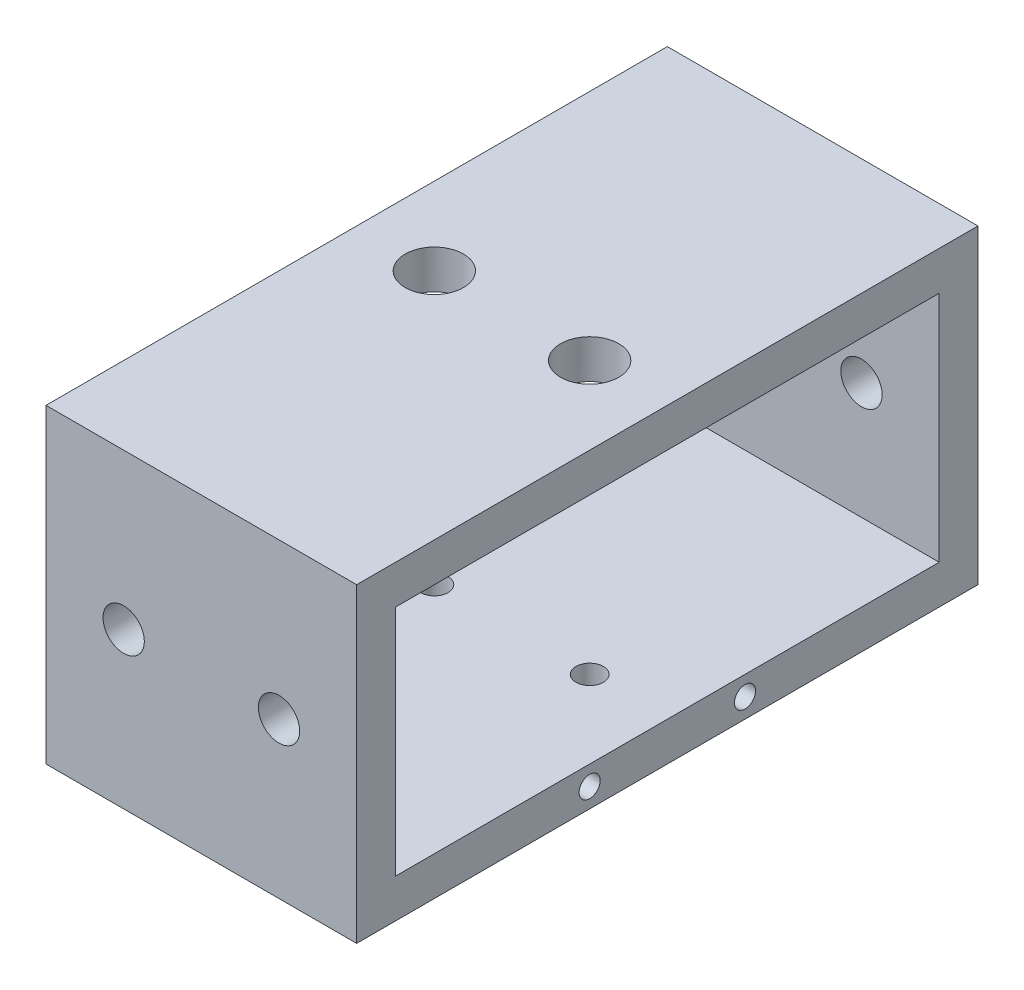
ISO-10303-21;
HEADER;
FILE_DESCRIPTION(('STEP AP214'),'2;1');
FILE_NAME('part.step','',(''),(''),'','','');
FILE_SCHEMA(('AUTOMOTIVE_DESIGN { 1 0 10303 214 1 1 1 1 }'));
ENDSEC;
DATA;
#1=APPLICATION_CONTEXT('core data for automotive mechanical design processes');
#2=APPLICATION_PROTOCOL_DEFINITION('international standard','automotive_design',2000,#1);
#3=PRODUCT_CONTEXT('',#1,'mechanical');
#4=PRODUCT('Part','Part','',(#3));
#5=PRODUCT_RELATED_PRODUCT_CATEGORY('part','',(#4));
#6=PRODUCT_DEFINITION_FORMATION('','',#4);
#7=PRODUCT_DEFINITION_CONTEXT('part definition',#1,'design');
#8=PRODUCT_DEFINITION('design','',#6,#7);
#9=PRODUCT_DEFINITION_SHAPE('','',#8);
#10=(LENGTH_UNIT() NAMED_UNIT(*) SI_UNIT(.MILLI.,.METRE.));
#11=(NAMED_UNIT(*) PLANE_ANGLE_UNIT() SI_UNIT($,.RADIAN.));
#12=(NAMED_UNIT(*) SI_UNIT($,.STERADIAN.) SOLID_ANGLE_UNIT());
#13=UNCERTAINTY_MEASURE_WITH_UNIT(LENGTH_MEASURE(1.E-05),#10,'distance_accuracy_value','');
#14=(GEOMETRIC_REPRESENTATION_CONTEXT(3) GLOBAL_UNCERTAINTY_ASSIGNED_CONTEXT((#13)) GLOBAL_UNIT_ASSIGNED_CONTEXT((#10,
#11,#12)) REPRESENTATION_CONTEXT('',''));
#15=CARTESIAN_POINT('',(0.,0.,0.));
#16=DIRECTION('',(0.,0.,1.));
#17=DIRECTION('',(1.,0.,0.));
#18=AXIS2_PLACEMENT_3D('',#15,#16,#17);
#19=CARTESIAN_POINT('',(25.4,25.4,50.8));
#20=DIRECTION('',(0.,-1.,0.));
#21=DIRECTION('',(0.,0.,-1.));
#22=AXIS2_PLACEMENT_3D('',#19,#20,#21);
#23=PLANE('',#22);
#24=CARTESIAN_POINT('',(12.7,25.4,0.));
#25=DIRECTION('',(0.,1.,0.));
#26=DIRECTION('',(0.,0.,1.));
#27=AXIS2_PLACEMENT_3D('',#24,#25,#26);
#28=CIRCLE('',#27,4.7625);
#29=CARTESIAN_POINT('',(12.7,25.4,4.7625));
#30=VERTEX_POINT('',#29);
#31=EDGE_CURVE('E139',#30,#30,#28,.T.);
#32=ORIENTED_EDGE('',*,*,#31,.F.);
#33=EDGE_LOOP('',(#32));
#34=FACE_BOUND('',#33,.T.);
#35=DIRECTION('',(0.,0.,1.));
#36=VECTOR('',#35,1.);
#37=CARTESIAN_POINT('',(-25.4,25.4,50.8));
#38=LINE('',#37,#36);
#39=CARTESIAN_POINT('',(-25.4,25.4,-50.8));
#40=VERTEX_POINT('',#39);
#41=CARTESIAN_POINT('',(-25.4,25.4,50.8));
#42=VERTEX_POINT('',#41);
#43=EDGE_CURVE('E215',#40,#42,#38,.T.);
#44=ORIENTED_EDGE('',*,*,#43,.T.);
#45=DIRECTION('',(-1.,0.,0.));
#46=VECTOR('',#45,1.);
#47=CARTESIAN_POINT('',(25.4,25.4,50.8));
#48=LINE('',#47,#46);
#49=CARTESIAN_POINT('',(25.4,25.4,50.8));
#50=VERTEX_POINT('',#49);
#51=EDGE_CURVE('E48',#50,#42,#48,.T.);
#52=ORIENTED_EDGE('',*,*,#51,.F.);
#53=DIRECTION('',(0.,0.,1.));
#54=VECTOR('',#53,1.);
#55=CARTESIAN_POINT('',(25.4,25.4,50.8));
#56=LINE('',#55,#54);
#57=CARTESIAN_POINT('',(25.4,25.4,-50.8));
#58=VERTEX_POINT('',#57);
#59=EDGE_CURVE('E205',#58,#50,#56,.T.);
#60=ORIENTED_EDGE('',*,*,#59,.F.);
#61=DIRECTION('',(-1.,0.,0.));
#62=VECTOR('',#61,1.);
#63=CARTESIAN_POINT('',(25.4,25.4,-50.8));
#64=LINE('',#63,#62);
#65=EDGE_CURVE('E11',#58,#40,#64,.T.);
#66=ORIENTED_EDGE('',*,*,#65,.T.);
#67=EDGE_LOOP('',(#44,#52,#60,#66));
#68=FACE_BOUND('',#67,.T.);
#69=CARTESIAN_POINT('',(-12.7,25.4,0.));
#70=DIRECTION('',(0.,1.,0.));
#71=DIRECTION('',(0.,0.,1.));
#72=AXIS2_PLACEMENT_3D('',#69,#70,#71);
#73=CIRCLE('',#72,4.7625);
#74=CARTESIAN_POINT('',(-12.7,25.4,4.7625));
#75=VERTEX_POINT('',#74);
#76=EDGE_CURVE('E133',#75,#75,#73,.T.);
#77=ORIENTED_EDGE('',*,*,#76,.F.);
#78=EDGE_LOOP('',(#77));
#79=FACE_BOUND('',#78,.T.);
#80=ADVANCED_FACE('F39',(#34,#68,#79),#23,.F.);
#81=CARTESIAN_POINT('',(25.4,-25.4,50.8));
#82=DIRECTION('',(0.,0.,-1.));
#83=DIRECTION('',(-1.,0.,0.));
#84=AXIS2_PLACEMENT_3D('',#81,#82,#83);
#85=PLANE('',#84);
#86=CARTESIAN_POINT('',(-12.7,0.,50.8));
#87=DIRECTION('',(0.,0.,1.));
#88=DIRECTION('',(1.,0.,0.));
#89=AXIS2_PLACEMENT_3D('',#86,#87,#88);
#90=CIRCLE('',#89,3.37819999999999);
#91=CARTESIAN_POINT('',(-9.3218,0.,50.8));
#92=VERTEX_POINT('',#91);
#93=EDGE_CURVE('E157',#92,#92,#90,.T.);
#94=ORIENTED_EDGE('',*,*,#93,.F.);
#95=EDGE_LOOP('',(#94));
#96=FACE_BOUND('',#95,.T.);
#97=DIRECTION('',(0.,-1.,0.));
#98=VECTOR('',#97,1.);
#99=CARTESIAN_POINT('',(-25.4,-25.4,50.8));
#100=LINE('',#99,#98);
#101=CARTESIAN_POINT('',(-25.4,-25.4,50.8));
#102=VERTEX_POINT('',#101);
#103=EDGE_CURVE('E217',#42,#102,#100,.T.);
#104=ORIENTED_EDGE('',*,*,#103,.T.);
#105=DIRECTION('',(-1.,0.,0.));
#106=VECTOR('',#105,1.);
#107=CARTESIAN_POINT('',(25.4,-25.4,50.8));
#108=LINE('',#107,#106);
#109=CARTESIAN_POINT('',(25.4,-25.4,50.8));
#110=VERTEX_POINT('',#109);
#111=EDGE_CURVE('E222',#110,#102,#108,.T.);
#112=ORIENTED_EDGE('',*,*,#111,.F.);
#113=DIRECTION('',(0.,-1.,0.));
#114=VECTOR('',#113,1.);
#115=CARTESIAN_POINT('',(25.4,-25.4,50.8));
#116=LINE('',#115,#114);
#117=EDGE_CURVE('E208',#50,#110,#116,.T.);
#118=ORIENTED_EDGE('',*,*,#117,.F.);
#119=ORIENTED_EDGE('',*,*,#51,.T.);
#120=EDGE_LOOP('',(#104,#112,#118,#119));
#121=FACE_BOUND('',#120,.T.);
#122=CARTESIAN_POINT('',(12.7,0.,50.8));
#123=DIRECTION('',(0.,0.,1.));
#124=DIRECTION('',(1.,0.,0.));
#125=AXIS2_PLACEMENT_3D('',#122,#123,#124);
#126=CIRCLE('',#125,3.37819999999999);
#127=CARTESIAN_POINT('',(16.0782,0.,50.8));
#128=VERTEX_POINT('',#127);
#129=EDGE_CURVE('E166',#128,#128,#126,.T.);
#130=ORIENTED_EDGE('',*,*,#129,.F.);
#131=EDGE_LOOP('',(#130));
#132=FACE_BOUND('',#131,.T.);
#133=ADVANCED_FACE('F250',(#96,#121,#132),#85,.F.);
#134=CARTESIAN_POINT('',(25.4,0.,0.));
#135=DIRECTION('',(-1.,0.,0.));
#136=DIRECTION('',(0.,0.,1.));
#137=AXIS2_PLACEMENT_3D('',#134,#135,#136);
#138=PLANE('',#137);
#139=CARTESIAN_POINT('',(25.4,-22.225,-12.7));
#140=DIRECTION('',(1.,0.,0.));
#141=DIRECTION('',(0.,0.,-1.));
#142=AXIS2_PLACEMENT_3D('',#139,#140,#141);
#143=CIRCLE('',#142,1.72719999999999);
#144=CARTESIAN_POINT('',(25.4,-22.225,-14.4272));
#145=VERTEX_POINT('',#144);
#146=EDGE_CURVE('E123',#145,#145,#143,.T.);
#147=ORIENTED_EDGE('',*,*,#146,.F.);
#148=EDGE_LOOP('',(#147));
#149=FACE_BOUND('',#148,.T.);
#150=CARTESIAN_POINT('',(25.4,-22.225,12.7));
#151=DIRECTION('',(1.,0.,0.));
#152=DIRECTION('',(0.,0.,-1.));
#153=AXIS2_PLACEMENT_3D('',#150,#151,#152);
#154=CIRCLE('',#153,1.72719999999999);
#155=CARTESIAN_POINT('',(25.4,-22.225,10.9728));
#156=VERTEX_POINT('',#155);
#157=EDGE_CURVE('E122',#156,#156,#154,.T.);
#158=ORIENTED_EDGE('',*,*,#157,.F.);
#159=EDGE_LOOP('',(#158));
#160=FACE_BOUND('',#159,.T.);
#161=DIRECTION('',(0.,1.,0.));
#162=VECTOR('',#161,1.);
#163=CARTESIAN_POINT('',(25.4,-25.4,-50.8));
#164=LINE('',#163,#162);
#165=CARTESIAN_POINT('',(25.4,-25.4,-50.8));
#166=VERTEX_POINT('',#165);
#167=EDGE_CURVE('E202',#166,#58,#164,.T.);
#168=ORIENTED_EDGE('',*,*,#167,.T.);
#169=ORIENTED_EDGE('',*,*,#59,.T.);
#170=ORIENTED_EDGE('',*,*,#117,.T.);
#171=DIRECTION('',(0.,0.,-1.));
#172=VECTOR('',#171,1.);
#173=CARTESIAN_POINT('',(25.4,-25.4,50.8));
#174=LINE('',#173,#172);
#175=EDGE_CURVE('E210',#110,#166,#174,.T.);
#176=ORIENTED_EDGE('',*,*,#175,.T.);
#177=EDGE_LOOP('',(#168,#169,#170,#176));
#178=FACE_BOUND('',#177,.T.);
#179=DIRECTION('',(0.,1.,0.));
#180=VECTOR('',#179,1.);
#181=CARTESIAN_POINT('',(25.4,-19.05,-44.45));
#182=LINE('',#181,#180);
#183=CARTESIAN_POINT('',(25.4,-19.05,-44.45));
#184=VERTEX_POINT('',#183);
#185=CARTESIAN_POINT('',(25.4,19.05,-44.45));
#186=VERTEX_POINT('',#185);
#187=EDGE_CURVE('E176',#184,#186,#182,.T.);
#188=ORIENTED_EDGE('',*,*,#187,.F.);
#189=DIRECTION('',(0.,0.,-1.));
#190=VECTOR('',#189,1.);
#191=CARTESIAN_POINT('',(25.4,-19.05,44.45));
#192=LINE('',#191,#190);
#193=CARTESIAN_POINT('',(25.4,-19.05,44.45));
#194=VERTEX_POINT('',#193);
#195=EDGE_CURVE('E183',#194,#184,#192,.T.);
#196=ORIENTED_EDGE('',*,*,#195,.F.);
#197=DIRECTION('',(0.,-1.,0.));
#198=VECTOR('',#197,1.);
#199=CARTESIAN_POINT('',(25.4,-19.05,44.45));
#200=LINE('',#199,#198);
#201=CARTESIAN_POINT('',(25.4,19.05,44.45));
#202=VERTEX_POINT('',#201);
#203=EDGE_CURVE('E181',#202,#194,#200,.T.);
#204=ORIENTED_EDGE('',*,*,#203,.F.);
#205=DIRECTION('',(0.,0.,1.));
#206=VECTOR('',#205,1.);
#207=CARTESIAN_POINT('',(25.4,19.05,44.45));
#208=LINE('',#207,#206);
#209=EDGE_CURVE('E178',#186,#202,#208,.T.);
#210=ORIENTED_EDGE('',*,*,#209,.F.);
#211=EDGE_LOOP('',(#188,#196,#204,#210));
#212=FACE_BOUND('',#211,.T.);
#213=ADVANCED_FACE('F255',(#149,#160,#178,#212),#138,.F.);
#214=CARTESIAN_POINT('',(-25.4,0.,0.));
#215=DIRECTION('',(-1.,0.,0.));
#216=DIRECTION('',(0.,0.,1.));
#217=AXIS2_PLACEMENT_3D('',#214,#215,#216);
#218=PLANE('',#217);
#219=DIRECTION('',(0.,1.,0.));
#220=VECTOR('',#219,1.);
#221=CARTESIAN_POINT('',(-25.4,-25.4,-50.8));
#222=LINE('',#221,#220);
#223=CARTESIAN_POINT('',(-25.4,-25.4,-50.8));
#224=VERTEX_POINT('',#223);
#225=EDGE_CURVE('E201',#224,#40,#222,.T.);
#226=ORIENTED_EDGE('',*,*,#225,.F.);
#227=DIRECTION('',(0.,0.,-1.));
#228=VECTOR('',#227,1.);
#229=CARTESIAN_POINT('',(-25.4,-25.4,50.8));
#230=LINE('',#229,#228);
#231=EDGE_CURVE('E206',#102,#224,#230,.T.);
#232=ORIENTED_EDGE('',*,*,#231,.F.);
#233=ORIENTED_EDGE('',*,*,#103,.F.);
#234=ORIENTED_EDGE('',*,*,#43,.F.);
#235=EDGE_LOOP('',(#226,#232,#233,#234));
#236=FACE_BOUND('',#235,.T.);
#237=DIRECTION('',(0.,0.,-1.));
#238=VECTOR('',#237,1.);
#239=CARTESIAN_POINT('',(-25.4,-19.05,44.45));
#240=LINE('',#239,#238);
#241=CARTESIAN_POINT('',(-25.4,-19.05,44.45));
#242=VERTEX_POINT('',#241);
#243=CARTESIAN_POINT('',(-25.4,-19.05,-44.45));
#244=VERTEX_POINT('',#243);
#245=EDGE_CURVE('E179',#242,#244,#240,.T.);
#246=ORIENTED_EDGE('',*,*,#245,.T.);
#247=DIRECTION('',(0.,1.,0.));
#248=VECTOR('',#247,1.);
#249=CARTESIAN_POINT('',(-25.4,-19.05,-44.45));
#250=LINE('',#249,#248);
#251=CARTESIAN_POINT('',(-25.4,19.05,-44.45));
#252=VERTEX_POINT('',#251);
#253=EDGE_CURVE('E64',#244,#252,#250,.T.);
#254=ORIENTED_EDGE('',*,*,#253,.T.);
#255=DIRECTION('',(0.,0.,1.));
#256=VECTOR('',#255,1.);
#257=CARTESIAN_POINT('',(-25.4,19.05,44.45));
#258=LINE('',#257,#256);
#259=CARTESIAN_POINT('',(-25.4,19.05,44.45));
#260=VERTEX_POINT('',#259);
#261=EDGE_CURVE('E187',#252,#260,#258,.T.);
#262=ORIENTED_EDGE('',*,*,#261,.T.);
#263=DIRECTION('',(0.,-1.,0.));
#264=VECTOR('',#263,1.);
#265=CARTESIAN_POINT('',(-25.4,-19.05,44.45));
#266=LINE('',#265,#264);
#267=EDGE_CURVE('E190',#260,#242,#266,.T.);
#268=ORIENTED_EDGE('',*,*,#267,.T.);
#269=EDGE_LOOP('',(#246,#254,#262,#268));
#270=FACE_BOUND('',#269,.T.);
#271=ADVANCED_FACE('F261',(#236,#270),#218,.T.);
#272=CARTESIAN_POINT('',(25.4,-25.4,-50.8));
#273=DIRECTION('',(0.,0.,1.));
#274=DIRECTION('',(1.,0.,0.));
#275=AXIS2_PLACEMENT_3D('',#272,#273,#274);
#276=PLANE('',#275);
#277=CARTESIAN_POINT('',(-12.7,0.,-50.8));
#278=DIRECTION('',(0.,0.,1.));
#279=DIRECTION('',(1.,0.,0.));
#280=AXIS2_PLACEMENT_3D('',#277,#278,#279);
#281=CIRCLE('',#280,3.37819999999998);
#282=CARTESIAN_POINT('',(-9.32180000000002,0.,-50.8));
#283=VERTEX_POINT('',#282);
#284=EDGE_CURVE('E160',#283,#283,#281,.T.);
#285=ORIENTED_EDGE('',*,*,#284,.T.);
#286=EDGE_LOOP('',(#285));
#287=FACE_BOUND('',#286,.T.);
#288=CARTESIAN_POINT('',(12.7,0.,-50.8));
#289=DIRECTION('',(0.,0.,1.));
#290=DIRECTION('',(1.,0.,0.));
#291=AXIS2_PLACEMENT_3D('',#288,#289,#290);
#292=CIRCLE('',#291,3.37819999999998);
#293=CARTESIAN_POINT('',(16.0782,0.,-50.8));
#294=VERTEX_POINT('',#293);
#295=EDGE_CURVE('E169',#294,#294,#292,.T.);
#296=ORIENTED_EDGE('',*,*,#295,.T.);
#297=EDGE_LOOP('',(#296));
#298=FACE_BOUND('',#297,.T.);
#299=ORIENTED_EDGE('',*,*,#225,.T.);
#300=ORIENTED_EDGE('',*,*,#65,.F.);
#301=ORIENTED_EDGE('',*,*,#167,.F.);
#302=DIRECTION('',(-1.,0.,0.));
#303=VECTOR('',#302,1.);
#304=CARTESIAN_POINT('',(25.4,-25.4,-50.8));
#305=LINE('',#304,#303);
#306=EDGE_CURVE('E212',#166,#224,#305,.T.);
#307=ORIENTED_EDGE('',*,*,#306,.T.);
#308=EDGE_LOOP('',(#299,#300,#301,#307));
#309=FACE_BOUND('',#308,.T.);
#310=ADVANCED_FACE('F41',(#287,#298,#309),#276,.F.);
#311=CARTESIAN_POINT('',(25.4,-25.4,50.8));
#312=DIRECTION('',(0.,1.,0.));
#313=DIRECTION('',(0.,0.,1.));
#314=AXIS2_PLACEMENT_3D('',#311,#312,#313);
#315=PLANE('',#314);
#316=CARTESIAN_POINT('',(-12.7,-25.4,0.));
#317=DIRECTION('',(0.,1.,0.));
#318=DIRECTION('',(0.,0.,1.));
#319=AXIS2_PLACEMENT_3D('',#316,#317,#318);
#320=CIRCLE('',#319,2.2479);
#321=CARTESIAN_POINT('',(-12.7,-25.4,2.2479));
#322=VERTEX_POINT('',#321);
#323=EDGE_CURVE('E148',#322,#322,#320,.T.);
#324=ORIENTED_EDGE('',*,*,#323,.T.);
#325=EDGE_LOOP('',(#324));
#326=FACE_BOUND('',#325,.T.);
#327=CARTESIAN_POINT('',(12.7,-25.4,0.));
#328=DIRECTION('',(0.,1.,0.));
#329=DIRECTION('',(0.,0.,1.));
#330=AXIS2_PLACEMENT_3D('',#327,#328,#329);
#331=CIRCLE('',#330,2.2479);
#332=CARTESIAN_POINT('',(12.7,-25.4,2.2479));
#333=VERTEX_POINT('',#332);
#334=EDGE_CURVE('E154',#333,#333,#331,.T.);
#335=ORIENTED_EDGE('',*,*,#334,.T.);
#336=EDGE_LOOP('',(#335));
#337=FACE_BOUND('',#336,.T.);
#338=ORIENTED_EDGE('',*,*,#231,.T.);
#339=ORIENTED_EDGE('',*,*,#306,.F.);
#340=ORIENTED_EDGE('',*,*,#175,.F.);
#341=ORIENTED_EDGE('',*,*,#111,.T.);
#342=EDGE_LOOP('',(#338,#339,#340,#341));
#343=FACE_BOUND('',#342,.T.);
#344=ADVANCED_FACE('F235',(#326,#337,#343),#315,.F.);
#345=CARTESIAN_POINT('',(25.4,-19.05,-44.45));
#346=DIRECTION('',(0.,0.,1.));
#347=DIRECTION('',(1.,0.,0.));
#348=AXIS2_PLACEMENT_3D('',#345,#346,#347);
#349=PLANE('',#348);
#350=CARTESIAN_POINT('',(-12.7,0.,-44.45));
#351=DIRECTION('',(0.,0.,1.));
#352=DIRECTION('',(1.,0.,0.));
#353=AXIS2_PLACEMENT_3D('',#350,#351,#352);
#354=CIRCLE('',#353,3.37819999999999);
#355=CARTESIAN_POINT('',(-9.32180000000001,0.,-44.45));
#356=VERTEX_POINT('',#355);
#357=EDGE_CURVE('E163',#356,#356,#354,.T.);
#358=ORIENTED_EDGE('',*,*,#357,.F.);
#359=EDGE_LOOP('',(#358));
#360=FACE_BOUND('',#359,.T.);
#361=CARTESIAN_POINT('',(12.7,0.,-44.45));
#362=DIRECTION('',(0.,0.,1.));
#363=DIRECTION('',(1.,0.,0.));
#364=AXIS2_PLACEMENT_3D('',#361,#362,#363);
#365=CIRCLE('',#364,3.37819999999999);
#366=CARTESIAN_POINT('',(16.0782,0.,-44.45));
#367=VERTEX_POINT('',#366);
#368=EDGE_CURVE('E172',#367,#367,#365,.T.);
#369=ORIENTED_EDGE('',*,*,#368,.F.);
#370=EDGE_LOOP('',(#369));
#371=FACE_BOUND('',#370,.T.);
#372=ORIENTED_EDGE('',*,*,#253,.F.);
#373=DIRECTION('',(-1.,0.,0.));
#374=VECTOR('',#373,1.);
#375=CARTESIAN_POINT('',(25.4,-19.05,-44.45));
#376=LINE('',#375,#374);
#377=EDGE_CURVE('E185',#184,#244,#376,.T.);
#378=ORIENTED_EDGE('',*,*,#377,.F.);
#379=ORIENTED_EDGE('',*,*,#187,.T.);
#380=DIRECTION('',(-1.,0.,0.));
#381=VECTOR('',#380,1.);
#382=CARTESIAN_POINT('',(25.4,19.05,-44.45));
#383=LINE('',#382,#381);
#384=EDGE_CURVE('E199',#186,#252,#383,.T.);
#385=ORIENTED_EDGE('',*,*,#384,.T.);
#386=EDGE_LOOP('',(#372,#378,#379,#385));
#387=FACE_BOUND('',#386,.T.);
#388=ADVANCED_FACE('F232',(#360,#371,#387),#349,.T.);
#389=CARTESIAN_POINT('',(25.4,19.05,44.45));
#390=DIRECTION('',(0.,-1.,0.));
#391=DIRECTION('',(0.,0.,-1.));
#392=AXIS2_PLACEMENT_3D('',#389,#390,#391);
#393=PLANE('',#392);
#394=CARTESIAN_POINT('',(-12.7,19.05,0.));
#395=DIRECTION('',(0.,-1.,0.));
#396=DIRECTION('',(0.,0.,-1.));
#397=AXIS2_PLACEMENT_3D('',#394,#395,#396);
#398=CIRCLE('',#397,4.7625);
#399=CARTESIAN_POINT('',(-12.7,19.05,-4.76249999999999));
#400=VERTEX_POINT('',#399);
#401=EDGE_CURVE('E136',#400,#400,#398,.T.);
#402=ORIENTED_EDGE('',*,*,#401,.F.);
#403=EDGE_LOOP('',(#402));
#404=FACE_BOUND('',#403,.T.);
#405=CARTESIAN_POINT('',(12.7,19.05,0.));
#406=DIRECTION('',(0.,-1.,0.));
#407=DIRECTION('',(0.,0.,-1.));
#408=AXIS2_PLACEMENT_3D('',#405,#406,#407);
#409=CIRCLE('',#408,4.7625);
#410=CARTESIAN_POINT('',(12.7,19.05,-4.7625));
#411=VERTEX_POINT('',#410);
#412=EDGE_CURVE('E142',#411,#411,#409,.T.);
#413=ORIENTED_EDGE('',*,*,#412,.F.);
#414=EDGE_LOOP('',(#413));
#415=FACE_BOUND('',#414,.T.);
#416=ORIENTED_EDGE('',*,*,#261,.F.);
#417=ORIENTED_EDGE('',*,*,#384,.F.);
#418=ORIENTED_EDGE('',*,*,#209,.T.);
#419=DIRECTION('',(-1.,0.,0.));
#420=VECTOR('',#419,1.);
#421=CARTESIAN_POINT('',(25.4,19.05,44.45));
#422=LINE('',#421,#420);
#423=EDGE_CURVE('E197',#202,#260,#422,.T.);
#424=ORIENTED_EDGE('',*,*,#423,.T.);
#425=EDGE_LOOP('',(#416,#417,#418,#424));
#426=FACE_BOUND('',#425,.T.);
#427=ADVANCED_FACE('F234',(#404,#415,#426),#393,.T.);
#428=CARTESIAN_POINT('',(25.4,-19.05,44.45));
#429=DIRECTION('',(0.,0.,-1.));
#430=DIRECTION('',(-1.,0.,0.));
#431=AXIS2_PLACEMENT_3D('',#428,#429,#430);
#432=PLANE('',#431);
#433=CARTESIAN_POINT('',(-12.7,0.,44.45));
#434=DIRECTION('',(0.,0.,-1.));
#435=DIRECTION('',(-1.,0.,0.));
#436=AXIS2_PLACEMENT_3D('',#433,#434,#435);
#437=CIRCLE('',#436,3.37819999999999);
#438=CARTESIAN_POINT('',(-16.0782,0.,44.45));
#439=VERTEX_POINT('',#438);
#440=EDGE_CURVE('E43',#439,#439,#437,.T.);
#441=ORIENTED_EDGE('',*,*,#440,.F.);
#442=EDGE_LOOP('',(#441));
#443=FACE_BOUND('',#442,.T.);
#444=CARTESIAN_POINT('',(12.7,0.,44.45));
#445=DIRECTION('',(0.,0.,-1.));
#446=DIRECTION('',(-1.,0.,0.));
#447=AXIS2_PLACEMENT_3D('',#444,#445,#446);
#448=CIRCLE('',#447,3.37819999999999);
#449=CARTESIAN_POINT('',(9.32180000000001,0.,44.45));
#450=VERTEX_POINT('',#449);
#451=EDGE_CURVE('E173',#450,#450,#448,.T.);
#452=ORIENTED_EDGE('',*,*,#451,.F.);
#453=EDGE_LOOP('',(#452));
#454=FACE_BOUND('',#453,.T.);
#455=ORIENTED_EDGE('',*,*,#267,.F.);
#456=ORIENTED_EDGE('',*,*,#423,.F.);
#457=ORIENTED_EDGE('',*,*,#203,.T.);
#458=DIRECTION('',(-1.,0.,0.));
#459=VECTOR('',#458,1.);
#460=CARTESIAN_POINT('',(25.4,-19.05,44.45));
#461=LINE('',#460,#459);
#462=EDGE_CURVE('E56',#194,#242,#461,.T.);
#463=ORIENTED_EDGE('',*,*,#462,.T.);
#464=EDGE_LOOP('',(#455,#456,#457,#463));
#465=FACE_BOUND('',#464,.T.);
#466=ADVANCED_FACE('F242',(#443,#454,#465),#432,.T.);
#467=CARTESIAN_POINT('',(25.4,-19.05,44.45));
#468=DIRECTION('',(0.,1.,0.));
#469=DIRECTION('',(0.,0.,1.));
#470=AXIS2_PLACEMENT_3D('',#467,#468,#469);
#471=PLANE('',#470);
#472=CARTESIAN_POINT('',(-12.7,-19.05,0.));
#473=DIRECTION('',(0.,1.,0.));
#474=DIRECTION('',(0.,0.,1.));
#475=AXIS2_PLACEMENT_3D('',#472,#473,#474);
#476=CIRCLE('',#475,2.2479);
#477=CARTESIAN_POINT('',(-12.7,-19.05,2.2479));
#478=VERTEX_POINT('',#477);
#479=EDGE_CURVE('E145',#478,#478,#476,.T.);
#480=ORIENTED_EDGE('',*,*,#479,.F.);
#481=EDGE_LOOP('',(#480));
#482=FACE_BOUND('',#481,.T.);
#483=CARTESIAN_POINT('',(12.7,-19.05,0.));
#484=DIRECTION('',(0.,1.,0.));
#485=DIRECTION('',(0.,0.,1.));
#486=AXIS2_PLACEMENT_3D('',#483,#484,#485);
#487=CIRCLE('',#486,2.2479);
#488=CARTESIAN_POINT('',(12.7,-19.05,2.2479));
#489=VERTEX_POINT('',#488);
#490=EDGE_CURVE('E151',#489,#489,#487,.T.);
#491=ORIENTED_EDGE('',*,*,#490,.F.);
#492=EDGE_LOOP('',(#491));
#493=FACE_BOUND('',#492,.T.);
#494=ORIENTED_EDGE('',*,*,#245,.F.);
#495=ORIENTED_EDGE('',*,*,#462,.F.);
#496=ORIENTED_EDGE('',*,*,#195,.T.);
#497=ORIENTED_EDGE('',*,*,#377,.T.);
#498=EDGE_LOOP('',(#494,#495,#496,#497));
#499=FACE_BOUND('',#498,.T.);
#500=ADVANCED_FACE('F284',(#482,#493,#499),#471,.T.);
#501=CARTESIAN_POINT('',(12.7,0.,50.8));
#502=DIRECTION('',(0.,0.,1.));
#503=DIRECTION('',(1.,0.,0.));
#504=AXIS2_PLACEMENT_3D('',#501,#502,#503);
#505=CYLINDRICAL_SURFACE('',#504,3.37819999999999);
#506=ORIENTED_EDGE('',*,*,#368,.T.);
#507=EDGE_LOOP('',(#506));
#508=FACE_BOUND('',#507,.T.);
#509=ORIENTED_EDGE('',*,*,#295,.F.);
#510=EDGE_LOOP('',(#509));
#511=FACE_BOUND('',#510,.T.);
#512=ADVANCED_FACE('F229',(#508,#511),#505,.F.);
#513=ORIENTED_EDGE('',*,*,#451,.T.);
#514=EDGE_LOOP('',(#513));
#515=FACE_BOUND('',#514,.T.);
#516=ORIENTED_EDGE('',*,*,#129,.T.);
#517=EDGE_LOOP('',(#516));
#518=FACE_BOUND('',#517,.T.);
#519=ADVANCED_FACE('F292',(#515,#518),#505,.F.);
#520=CARTESIAN_POINT('',(-12.7,0.,50.8));
#521=DIRECTION('',(0.,0.,1.));
#522=DIRECTION('',(1.,0.,0.));
#523=AXIS2_PLACEMENT_3D('',#520,#521,#522);
#524=CYLINDRICAL_SURFACE('',#523,3.37819999999999);
#525=ORIENTED_EDGE('',*,*,#440,.T.);
#526=EDGE_LOOP('',(#525));
#527=FACE_BOUND('',#526,.T.);
#528=ORIENTED_EDGE('',*,*,#93,.T.);
#529=EDGE_LOOP('',(#528));
#530=FACE_BOUND('',#529,.T.);
#531=ADVANCED_FACE('F299',(#527,#530),#524,.F.);
#532=ORIENTED_EDGE('',*,*,#357,.T.);
#533=EDGE_LOOP('',(#532));
#534=FACE_BOUND('',#533,.T.);
#535=ORIENTED_EDGE('',*,*,#284,.F.);
#536=EDGE_LOOP('',(#535));
#537=FACE_BOUND('',#536,.T.);
#538=ADVANCED_FACE('F302',(#534,#537),#524,.F.);
#539=CARTESIAN_POINT('',(12.7,-19.05,0.));
#540=DIRECTION('',(0.,1.,0.));
#541=DIRECTION('',(0.,0.,1.));
#542=AXIS2_PLACEMENT_3D('',#539,#540,#541);
#543=CYLINDRICAL_SURFACE('',#542,2.2479);
#544=ORIENTED_EDGE('',*,*,#334,.F.);
#545=EDGE_LOOP('',(#544));
#546=FACE_BOUND('',#545,.T.);
#547=ORIENTED_EDGE('',*,*,#490,.T.);
#548=EDGE_LOOP('',(#547));
#549=FACE_BOUND('',#548,.T.);
#550=ADVANCED_FACE('F304',(#546,#549),#543,.F.);
#551=CARTESIAN_POINT('',(-12.7,-19.05,0.));
#552=DIRECTION('',(0.,1.,0.));
#553=DIRECTION('',(0.,0.,1.));
#554=AXIS2_PLACEMENT_3D('',#551,#552,#553);
#555=CYLINDRICAL_SURFACE('',#554,2.2479);
#556=ORIENTED_EDGE('',*,*,#323,.F.);
#557=EDGE_LOOP('',(#556));
#558=FACE_BOUND('',#557,.T.);
#559=ORIENTED_EDGE('',*,*,#479,.T.);
#560=EDGE_LOOP('',(#559));
#561=FACE_BOUND('',#560,.T.);
#562=ADVANCED_FACE('F307',(#558,#561),#555,.F.);
#563=CARTESIAN_POINT('',(12.7,25.4,0.));
#564=DIRECTION('',(0.,1.,0.));
#565=DIRECTION('',(0.,0.,1.));
#566=AXIS2_PLACEMENT_3D('',#563,#564,#565);
#567=CYLINDRICAL_SURFACE('',#566,4.7625);
#568=ORIENTED_EDGE('',*,*,#31,.T.);
#569=EDGE_LOOP('',(#568));
#570=FACE_BOUND('',#569,.T.);
#571=ORIENTED_EDGE('',*,*,#412,.T.);
#572=EDGE_LOOP('',(#571));
#573=FACE_BOUND('',#572,.T.);
#574=ADVANCED_FACE('F311',(#570,#573),#567,.F.);
#575=CARTESIAN_POINT('',(-12.7,25.4,0.));
#576=DIRECTION('',(0.,1.,0.));
#577=DIRECTION('',(0.,0.,1.));
#578=AXIS2_PLACEMENT_3D('',#575,#576,#577);
#579=CYLINDRICAL_SURFACE('',#578,4.7625);
#580=ORIENTED_EDGE('',*,*,#76,.T.);
#581=EDGE_LOOP('',(#580));
#582=FACE_BOUND('',#581,.T.);
#583=ORIENTED_EDGE('',*,*,#401,.T.);
#584=EDGE_LOOP('',(#583));
#585=FACE_BOUND('',#584,.T.);
#586=ADVANCED_FACE('F315',(#582,#585),#579,.F.);
#587=CARTESIAN_POINT('',(12.7,-22.225,12.7));
#588=DIRECTION('',(1.,0.,0.));
#589=DIRECTION('',(0.,0.,-1.));
#590=AXIS2_PLACEMENT_3D('',#587,#588,#589);
#591=CONICAL_SURFACE('',#590,1.7272,1.02974425867665);
#592=CARTESIAN_POINT('',(11.6621935388156,-22.225,12.7));
#593=VERTEX_POINT('',#592);
#594=VERTEX_LOOP('',#593);
#595=FACE_BOUND('',#594,.T.);
#596=CARTESIAN_POINT('',(12.7,-22.225,12.7));
#597=DIRECTION('',(1.,0.,0.));
#598=DIRECTION('',(0.,0.,-1.));
#599=AXIS2_PLACEMENT_3D('',#596,#597,#598);
#600=CIRCLE('',#599,1.7272);
#601=CARTESIAN_POINT('',(12.7,-22.225,10.9728));
#602=VERTEX_POINT('',#601);
#603=EDGE_CURVE('E126',#602,#602,#600,.T.);
#604=ORIENTED_EDGE('',*,*,#603,.T.);
#605=EDGE_LOOP('',(#604));
#606=FACE_BOUND('',#605,.T.);
#607=ADVANCED_FACE('F319',(#595,#606),#591,.F.);
#608=CARTESIAN_POINT('',(25.4,-22.225,12.7));
#609=DIRECTION('',(1.,0.,0.));
#610=DIRECTION('',(0.,0.,-1.));
#611=AXIS2_PLACEMENT_3D('',#608,#609,#610);
#612=CYLINDRICAL_SURFACE('',#611,1.72719999999999);
#613=ORIENTED_EDGE('',*,*,#603,.F.);
#614=EDGE_LOOP('',(#613));
#615=FACE_BOUND('',#614,.T.);
#616=ORIENTED_EDGE('',*,*,#157,.T.);
#617=EDGE_LOOP('',(#616));
#618=FACE_BOUND('',#617,.T.);
#619=ADVANCED_FACE('F116',(#615,#618),#612,.F.);
#620=CARTESIAN_POINT('',(12.7,-22.225,-12.7));
#621=DIRECTION('',(1.,0.,0.));
#622=DIRECTION('',(0.,0.,-1.));
#623=AXIS2_PLACEMENT_3D('',#620,#621,#622);
#624=CONICAL_SURFACE('',#623,1.7272,1.02974425867665);
#625=CARTESIAN_POINT('',(11.6621935388156,-22.225,-12.7));
#626=VERTEX_POINT('',#625);
#627=VERTEX_LOOP('',#626);
#628=FACE_BOUND('',#627,.T.);
#629=CARTESIAN_POINT('',(12.7,-22.225,-12.7));
#630=DIRECTION('',(1.,0.,0.));
#631=DIRECTION('',(0.,0.,-1.));
#632=AXIS2_PLACEMENT_3D('',#629,#630,#631);
#633=CIRCLE('',#632,1.7272);
#634=CARTESIAN_POINT('',(12.7,-22.225,-14.4272));
#635=VERTEX_POINT('',#634);
#636=EDGE_CURVE('E120',#635,#635,#633,.T.);
#637=ORIENTED_EDGE('',*,*,#636,.T.);
#638=EDGE_LOOP('',(#637));
#639=FACE_BOUND('',#638,.T.);
#640=ADVANCED_FACE('F112',(#628,#639),#624,.F.);
#641=CARTESIAN_POINT('',(25.4,-22.225,-12.7));
#642=DIRECTION('',(1.,0.,0.));
#643=DIRECTION('',(0.,0.,-1.));
#644=AXIS2_PLACEMENT_3D('',#641,#642,#643);
#645=CYLINDRICAL_SURFACE('',#644,1.72719999999999);
#646=ORIENTED_EDGE('',*,*,#636,.F.);
#647=EDGE_LOOP('',(#646));
#648=FACE_BOUND('',#647,.T.);
#649=ORIENTED_EDGE('',*,*,#146,.T.);
#650=EDGE_LOOP('',(#649));
#651=FACE_BOUND('',#650,.T.);
#652=ADVANCED_FACE('F115',(#648,#651),#645,.F.);
#653=CLOSED_SHELL('',(#80,#133,#213,#271,#310,#344,#388,#427,#466,#500,#512,#519,#531,#538,#550,
#562,#574,#586,#607,#619,#640,#652));
#654=MANIFOLD_SOLID_BREP('B2',#653);
#655=ADVANCED_BREP_SHAPE_REPRESENTATION('',(#18,#654),#14);
#656=SHAPE_DEFINITION_REPRESENTATION(#9,#655);
ENDSEC;
END-ISO-10303-21;
